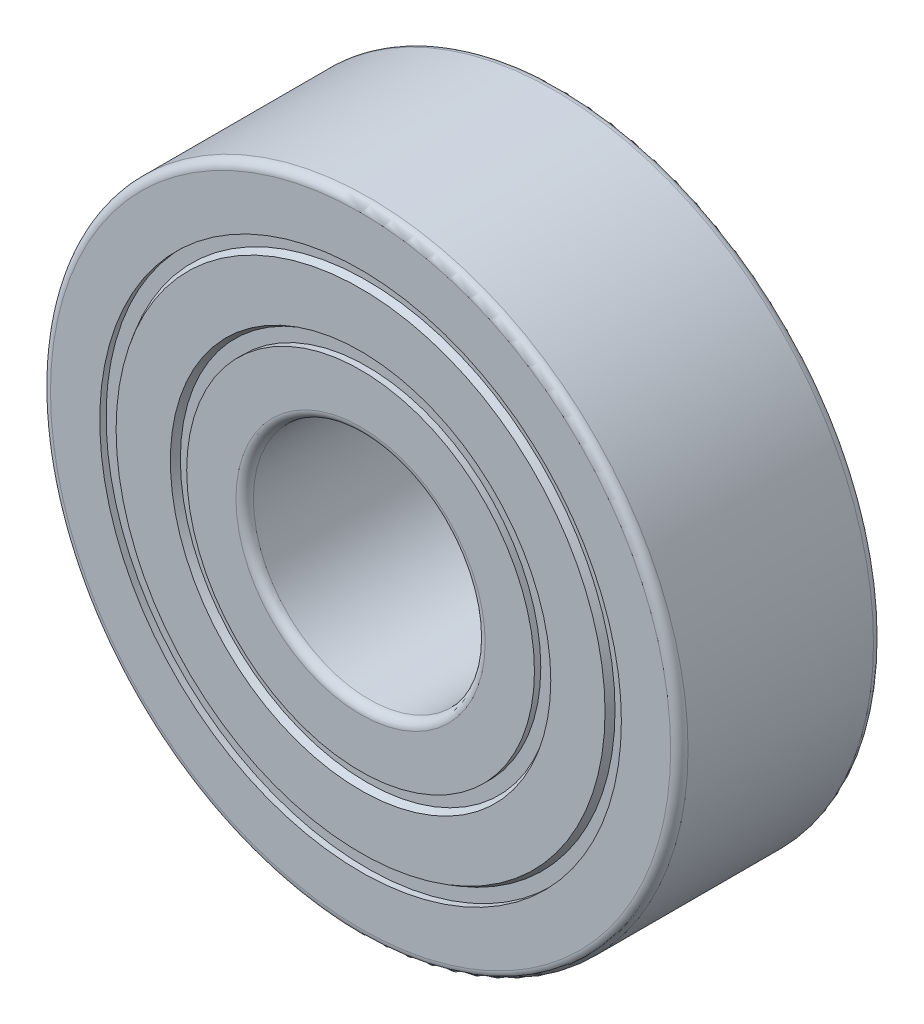
ISO-10303-21;
HEADER;
FILE_DESCRIPTION(('STEP AP214'),'2;1');
FILE_NAME('part.step','',(''),(''),'','','');
FILE_SCHEMA(('AUTOMOTIVE_DESIGN { 1 0 10303 214 1 1 1 1 }'));
ENDSEC;
DATA;
#1=APPLICATION_CONTEXT('core data for automotive mechanical design processes');
#2=APPLICATION_PROTOCOL_DEFINITION('international standard','automotive_design',2000,#1);
#3=PRODUCT_CONTEXT('',#1,'mechanical');
#4=PRODUCT('Part','Part','',(#3));
#5=PRODUCT_RELATED_PRODUCT_CATEGORY('part','',(#4));
#6=PRODUCT_DEFINITION_FORMATION('','',#4);
#7=PRODUCT_DEFINITION_CONTEXT('part definition',#1,'design');
#8=PRODUCT_DEFINITION('design','',#6,#7);
#9=PRODUCT_DEFINITION_SHAPE('','',#8);
#10=(LENGTH_UNIT() NAMED_UNIT(*) SI_UNIT(.MILLI.,.METRE.));
#11=(NAMED_UNIT(*) PLANE_ANGLE_UNIT() SI_UNIT($,.RADIAN.));
#12=(NAMED_UNIT(*) SI_UNIT($,.STERADIAN.) SOLID_ANGLE_UNIT());
#13=UNCERTAINTY_MEASURE_WITH_UNIT(LENGTH_MEASURE(1.E-05),#10,'distance_accuracy_value','');
#14=(GEOMETRIC_REPRESENTATION_CONTEXT(3) GLOBAL_UNCERTAINTY_ASSIGNED_CONTEXT((#13)) GLOBAL_UNIT_ASSIGNED_CONTEXT((#10,
#11,#12)) REPRESENTATION_CONTEXT('',''));
#15=CARTESIAN_POINT('',(0.,0.,0.));
#16=DIRECTION('',(0.,0.,1.));
#17=DIRECTION('',(1.,0.,0.));
#18=AXIS2_PLACEMENT_3D('',#15,#16,#17);
#19=CARTESIAN_POINT('',(-9.,0.,7.));
#20=DIRECTION('',(0.,0.,-1.));
#21=DIRECTION('',(-1.,0.,0.));
#22=AXIS2_PLACEMENT_3D('',#19,#20,#21);
#23=PLANE('',#22);
#24=CARTESIAN_POINT('',(0.,0.,7.));
#25=DIRECTION('',(0.,0.,1.));
#26=DIRECTION('',(1.,0.,0.));
#27=AXIS2_PLACEMENT_3D('',#24,#25,#26);
#28=CIRCLE('',#27,9.);
#29=CARTESIAN_POINT('',(9.,0.,7.));
#30=VERTEX_POINT('',#29);
#31=EDGE_CURVE('E10',#30,#30,#28,.T.);
#32=ORIENTED_EDGE('',*,*,#31,.F.);
#33=EDGE_LOOP('',(#32));
#34=FACE_BOUND('',#33,.T.);
#35=CARTESIAN_POINT('',(0.,0.,7.));
#36=DIRECTION('',(0.,0.,1.));
#37=DIRECTION('',(1.,0.,0.));
#38=AXIS2_PLACEMENT_3D('',#35,#36,#37);
#39=CIRCLE('',#38,10.7);
#40=CARTESIAN_POINT('',(10.7,0.,7.));
#41=VERTEX_POINT('',#40);
#42=EDGE_CURVE('E108',#41,#41,#39,.T.);
#43=ORIENTED_EDGE('',*,*,#42,.T.);
#44=EDGE_LOOP('',(#43));
#45=FACE_BOUND('',#44,.T.);
#46=ADVANCED_FACE('F31',(#34,#45),#23,.F.);
#47=CARTESIAN_POINT('',(0.,0.,19.));
#48=DIRECTION('',(0.,0.,1.));
#49=DIRECTION('',(1.,0.,0.));
#50=AXIS2_PLACEMENT_3D('',#47,#48,#49);
#51=CYLINDRICAL_SURFACE('',#50,9.);
#52=CARTESIAN_POINT('',(0.,0.,6.78125));
#53=DIRECTION('',(0.,0.,1.));
#54=DIRECTION('',(1.,0.,0.));
#55=AXIS2_PLACEMENT_3D('',#52,#53,#54);
#56=CIRCLE('',#55,9.);
#57=CARTESIAN_POINT('',(9.,0.,6.78125));
#58=VERTEX_POINT('',#57);
#59=EDGE_CURVE('E38',#58,#58,#56,.T.);
#60=ORIENTED_EDGE('',*,*,#59,.F.);
#61=EDGE_LOOP('',(#60));
#62=FACE_BOUND('',#61,.T.);
#63=ORIENTED_EDGE('',*,*,#31,.T.);
#64=EDGE_LOOP('',(#63));
#65=FACE_BOUND('',#64,.T.);
#66=ADVANCED_FACE('F241',(#62,#65),#51,.F.);
#67=CARTESIAN_POINT('',(-9.,0.,6.78125));
#68=DIRECTION('',(0.,0.,-1.));
#69=DIRECTION('',(-1.,0.,0.));
#70=AXIS2_PLACEMENT_3D('',#67,#68,#69);
#71=PLANE('',#70);
#72=CARTESIAN_POINT('',(0.,0.,6.78125));
#73=DIRECTION('',(0.,0.,1.));
#74=DIRECTION('',(1.,0.,0.));
#75=AXIS2_PLACEMENT_3D('',#72,#73,#74);
#76=CIRCLE('',#75,8.5625);
#77=CARTESIAN_POINT('',(8.5625,0.,6.78125));
#78=VERTEX_POINT('',#77);
#79=EDGE_CURVE('E42',#78,#78,#76,.T.);
#80=ORIENTED_EDGE('',*,*,#79,.F.);
#81=EDGE_LOOP('',(#80));
#82=FACE_BOUND('',#81,.T.);
#83=ORIENTED_EDGE('',*,*,#59,.T.);
#84=EDGE_LOOP('',(#83));
#85=FACE_BOUND('',#84,.T.);
#86=ADVANCED_FACE('F236',(#82,#85),#71,.F.);
#87=CARTESIAN_POINT('',(0.,0.,6.78125));
#88=DIRECTION('',(0.,0.,-1.));
#89=DIRECTION('',(-1.,0.,0.));
#90=AXIS2_PLACEMENT_3D('',#87,#88,#89);
#91=CONICAL_SURFACE('',#90,8.5625,0.523598775598308);
#92=CARTESIAN_POINT('',(0.,0.,7.));
#93=DIRECTION('',(0.,0.,1.));
#94=DIRECTION('',(1.,0.,0.));
#95=AXIS2_PLACEMENT_3D('',#92,#93,#94);
#96=CIRCLE('',#95,8.43620462861477);
#97=CARTESIAN_POINT('',(8.43620462861477,0.,7.));
#98=VERTEX_POINT('',#97);
#99=EDGE_CURVE('E46',#98,#98,#96,.T.);
#100=ORIENTED_EDGE('',*,*,#99,.F.);
#101=EDGE_LOOP('',(#100));
#102=FACE_BOUND('',#101,.T.);
#103=ORIENTED_EDGE('',*,*,#79,.T.);
#104=EDGE_LOOP('',(#103));
#105=FACE_BOUND('',#104,.T.);
#106=ADVANCED_FACE('F230',(#102,#105),#91,.T.);
#107=CARTESIAN_POINT('',(-8.43620462861477,0.,7.));
#108=DIRECTION('',(0.,0.,-1.));
#109=DIRECTION('',(-1.,0.,0.));
#110=AXIS2_PLACEMENT_3D('',#107,#108,#109);
#111=PLANE('',#110);
#112=CARTESIAN_POINT('',(0.,0.,7.));
#113=DIRECTION('',(0.,0.,1.));
#114=DIRECTION('',(1.,0.,0.));
#115=AXIS2_PLACEMENT_3D('',#112,#113,#114);
#116=CIRCLE('',#115,6.56379537138523);
#117=CARTESIAN_POINT('',(6.56379537138523,0.,7.));
#118=VERTEX_POINT('',#117);
#119=EDGE_CURVE('E51',#118,#118,#116,.T.);
#120=ORIENTED_EDGE('',*,*,#119,.F.);
#121=EDGE_LOOP('',(#120));
#122=FACE_BOUND('',#121,.T.);
#123=ORIENTED_EDGE('',*,*,#99,.T.);
#124=EDGE_LOOP('',(#123));
#125=FACE_BOUND('',#124,.T.);
#126=ADVANCED_FACE('F224',(#122,#125),#111,.F.);
#127=CARTESIAN_POINT('',(0.,0.,7.));
#128=DIRECTION('',(0.,0.,1.));
#129=DIRECTION('',(1.,0.,0.));
#130=AXIS2_PLACEMENT_3D('',#127,#128,#129);
#131=CONICAL_SURFACE('',#130,6.56379537138523,0.523598775598303);
#132=CARTESIAN_POINT('',(0.,0.,6.78125));
#133=DIRECTION('',(0.,0.,1.));
#134=DIRECTION('',(1.,0.,0.));
#135=AXIS2_PLACEMENT_3D('',#132,#133,#134);
#136=CIRCLE('',#135,6.4375);
#137=CARTESIAN_POINT('',(6.4375,0.,6.78125));
#138=VERTEX_POINT('',#137);
#139=EDGE_CURVE('E54',#138,#138,#136,.T.);
#140=ORIENTED_EDGE('',*,*,#139,.F.);
#141=EDGE_LOOP('',(#140));
#142=FACE_BOUND('',#141,.T.);
#143=ORIENTED_EDGE('',*,*,#119,.T.);
#144=EDGE_LOOP('',(#143));
#145=FACE_BOUND('',#144,.T.);
#146=ADVANCED_FACE('F218',(#142,#145),#131,.F.);
#147=CARTESIAN_POINT('',(-6.,0.,6.78125));
#148=DIRECTION('',(0.,0.,-1.));
#149=DIRECTION('',(-1.,0.,0.));
#150=AXIS2_PLACEMENT_3D('',#147,#148,#149);
#151=PLANE('',#150);
#152=CARTESIAN_POINT('',(0.,0.,6.78125));
#153=DIRECTION('',(0.,0.,1.));
#154=DIRECTION('',(1.,0.,0.));
#155=AXIS2_PLACEMENT_3D('',#152,#153,#154);
#156=CIRCLE('',#155,6.);
#157=CARTESIAN_POINT('',(6.,0.,6.78125));
#158=VERTEX_POINT('',#157);
#159=EDGE_CURVE('E57',#158,#158,#156,.T.);
#160=ORIENTED_EDGE('',*,*,#159,.F.);
#161=EDGE_LOOP('',(#160));
#162=FACE_BOUND('',#161,.T.);
#163=ORIENTED_EDGE('',*,*,#139,.T.);
#164=EDGE_LOOP('',(#163));
#165=FACE_BOUND('',#164,.T.);
#166=ADVANCED_FACE('F212',(#162,#165),#151,.F.);
#167=CARTESIAN_POINT('',(0.,0.,19.));
#168=DIRECTION('',(0.,0.,1.));
#169=DIRECTION('',(1.,0.,0.));
#170=AXIS2_PLACEMENT_3D('',#167,#168,#169);
#171=CYLINDRICAL_SURFACE('',#170,6.);
#172=CARTESIAN_POINT('',(0.,0.,7.));
#173=DIRECTION('',(0.,0.,1.));
#174=DIRECTION('',(1.,0.,0.));
#175=AXIS2_PLACEMENT_3D('',#172,#173,#174);
#176=CIRCLE('',#175,6.);
#177=CARTESIAN_POINT('',(6.,0.,7.));
#178=VERTEX_POINT('',#177);
#179=EDGE_CURVE('E60',#178,#178,#176,.T.);
#180=ORIENTED_EDGE('',*,*,#179,.F.);
#181=EDGE_LOOP('',(#180));
#182=FACE_BOUND('',#181,.T.);
#183=ORIENTED_EDGE('',*,*,#159,.T.);
#184=EDGE_LOOP('',(#183));
#185=FACE_BOUND('',#184,.T.);
#186=ADVANCED_FACE('F206',(#182,#185),#171,.T.);
#187=CARTESIAN_POINT('',(-4.3,0.,7.));
#188=DIRECTION('',(0.,0.,-1.));
#189=DIRECTION('',(-1.,0.,0.));
#190=AXIS2_PLACEMENT_3D('',#187,#188,#189);
#191=PLANE('',#190);
#192=CARTESIAN_POINT('',(0.,0.,7.));
#193=DIRECTION('',(0.,0.,1.));
#194=DIRECTION('',(1.,0.,0.));
#195=AXIS2_PLACEMENT_3D('',#192,#193,#194);
#196=CIRCLE('',#195,4.3);
#197=CARTESIAN_POINT('',(4.3,0.,7.));
#198=VERTEX_POINT('',#197);
#199=EDGE_CURVE('E63',#198,#198,#196,.T.);
#200=ORIENTED_EDGE('',*,*,#199,.F.);
#201=EDGE_LOOP('',(#200));
#202=FACE_BOUND('',#201,.T.);
#203=ORIENTED_EDGE('',*,*,#179,.T.);
#204=EDGE_LOOP('',(#203));
#205=FACE_BOUND('',#204,.T.);
#206=ADVANCED_FACE('F200',(#202,#205),#191,.F.);
#207=CARTESIAN_POINT('',(0.,0.,6.7));
#208=DIRECTION('',(0.,0.,1.));
#209=DIRECTION('',(1.,0.,0.));
#210=AXIS2_PLACEMENT_3D('',#207,#208,#209);
#211=TOROIDAL_SURFACE('',#210,4.3,0.3);
#212=CARTESIAN_POINT('',(0.,0.,6.7));
#213=DIRECTION('',(0.,0.,1.));
#214=DIRECTION('',(1.,0.,0.));
#215=AXIS2_PLACEMENT_3D('',#212,#213,#214);
#216=CIRCLE('',#215,4.);
#217=CARTESIAN_POINT('',(4.,0.,6.7));
#218=VERTEX_POINT('',#217);
#219=EDGE_CURVE('E66',#218,#218,#216,.T.);
#220=ORIENTED_EDGE('',*,*,#219,.F.);
#221=EDGE_LOOP('',(#220));
#222=FACE_BOUND('',#221,.T.);
#223=ORIENTED_EDGE('',*,*,#199,.T.);
#224=EDGE_LOOP('',(#223));
#225=FACE_BOUND('',#224,.T.);
#226=ADVANCED_FACE('F194',(#222,#225),#211,.T.);
#227=CARTESIAN_POINT('',(0.,0.,19.));
#228=DIRECTION('',(0.,0.,1.));
#229=DIRECTION('',(1.,0.,0.));
#230=AXIS2_PLACEMENT_3D('',#227,#228,#229);
#231=CYLINDRICAL_SURFACE('',#230,4.);
#232=CARTESIAN_POINT('',(0.,0.,0.300000000000002));
#233=DIRECTION('',(0.,0.,1.));
#234=DIRECTION('',(1.,0.,0.));
#235=AXIS2_PLACEMENT_3D('',#232,#233,#234);
#236=CIRCLE('',#235,4.);
#237=CARTESIAN_POINT('',(4.,0.,0.300000000000002));
#238=VERTEX_POINT('',#237);
#239=EDGE_CURVE('E69',#238,#238,#236,.T.);
#240=ORIENTED_EDGE('',*,*,#239,.F.);
#241=EDGE_LOOP('',(#240));
#242=FACE_BOUND('',#241,.T.);
#243=ORIENTED_EDGE('',*,*,#219,.T.);
#244=EDGE_LOOP('',(#243));
#245=FACE_BOUND('',#244,.T.);
#246=ADVANCED_FACE('F188',(#242,#245),#231,.F.);
#247=CARTESIAN_POINT('',(0.,0.,0.300000000000001));
#248=DIRECTION('',(0.,0.,1.));
#249=DIRECTION('',(1.,0.,0.));
#250=AXIS2_PLACEMENT_3D('',#247,#248,#249);
#251=TOROIDAL_SURFACE('',#250,4.3,0.3);
#252=CARTESIAN_POINT('',(0.,0.,0.));
#253=DIRECTION('',(0.,0.,1.));
#254=DIRECTION('',(1.,0.,0.));
#255=AXIS2_PLACEMENT_3D('',#252,#253,#254);
#256=CIRCLE('',#255,4.3);
#257=CARTESIAN_POINT('',(4.3,0.,0.));
#258=VERTEX_POINT('',#257);
#259=EDGE_CURVE('E72',#258,#258,#256,.T.);
#260=ORIENTED_EDGE('',*,*,#259,.F.);
#261=EDGE_LOOP('',(#260));
#262=FACE_BOUND('',#261,.T.);
#263=ORIENTED_EDGE('',*,*,#239,.T.);
#264=EDGE_LOOP('',(#263));
#265=FACE_BOUND('',#264,.T.);
#266=ADVANCED_FACE('F182',(#262,#265),#251,.T.);
#267=CARTESIAN_POINT('',(-4.3,0.,0.));
#268=DIRECTION('',(0.,0.,1.));
#269=DIRECTION('',(1.,0.,0.));
#270=AXIS2_PLACEMENT_3D('',#267,#268,#269);
#271=PLANE('',#270);
#272=CARTESIAN_POINT('',(0.,0.,0.));
#273=DIRECTION('',(0.,0.,1.));
#274=DIRECTION('',(1.,0.,0.));
#275=AXIS2_PLACEMENT_3D('',#272,#273,#274);
#276=CIRCLE('',#275,6.);
#277=CARTESIAN_POINT('',(6.,0.,0.));
#278=VERTEX_POINT('',#277);
#279=EDGE_CURVE('E75',#278,#278,#276,.T.);
#280=ORIENTED_EDGE('',*,*,#279,.F.);
#281=EDGE_LOOP('',(#280));
#282=FACE_BOUND('',#281,.T.);
#283=ORIENTED_EDGE('',*,*,#259,.T.);
#284=EDGE_LOOP('',(#283));
#285=FACE_BOUND('',#284,.T.);
#286=ADVANCED_FACE('F176',(#282,#285),#271,.F.);
#287=CARTESIAN_POINT('',(0.,0.,19.));
#288=DIRECTION('',(0.,0.,1.));
#289=DIRECTION('',(1.,0.,0.));
#290=AXIS2_PLACEMENT_3D('',#287,#288,#289);
#291=CYLINDRICAL_SURFACE('',#290,6.);
#292=CARTESIAN_POINT('',(0.,0.,0.21875));
#293=DIRECTION('',(0.,0.,1.));
#294=DIRECTION('',(1.,0.,0.));
#295=AXIS2_PLACEMENT_3D('',#292,#293,#294);
#296=CIRCLE('',#295,6.);
#297=CARTESIAN_POINT('',(6.,0.,0.21875));
#298=VERTEX_POINT('',#297);
#299=EDGE_CURVE('E78',#298,#298,#296,.T.);
#300=ORIENTED_EDGE('',*,*,#299,.F.);
#301=EDGE_LOOP('',(#300));
#302=FACE_BOUND('',#301,.T.);
#303=ORIENTED_EDGE('',*,*,#279,.T.);
#304=EDGE_LOOP('',(#303));
#305=FACE_BOUND('',#304,.T.);
#306=ADVANCED_FACE('F170',(#302,#305),#291,.T.);
#307=CARTESIAN_POINT('',(-6.,0.,0.21875));
#308=DIRECTION('',(0.,0.,1.));
#309=DIRECTION('',(1.,0.,0.));
#310=AXIS2_PLACEMENT_3D('',#307,#308,#309);
#311=PLANE('',#310);
#312=CARTESIAN_POINT('',(0.,0.,0.21875));
#313=DIRECTION('',(0.,0.,1.));
#314=DIRECTION('',(1.,0.,0.));
#315=AXIS2_PLACEMENT_3D('',#312,#313,#314);
#316=CIRCLE('',#315,6.4375);
#317=CARTESIAN_POINT('',(6.4375,0.,0.21875));
#318=VERTEX_POINT('',#317);
#319=EDGE_CURVE('E81',#318,#318,#316,.T.);
#320=ORIENTED_EDGE('',*,*,#319,.F.);
#321=EDGE_LOOP('',(#320));
#322=FACE_BOUND('',#321,.T.);
#323=ORIENTED_EDGE('',*,*,#299,.T.);
#324=EDGE_LOOP('',(#323));
#325=FACE_BOUND('',#324,.T.);
#326=ADVANCED_FACE('F164',(#322,#325),#311,.F.);
#327=CARTESIAN_POINT('',(0.,0.,0.21875));
#328=DIRECTION('',(0.,0.,-1.));
#329=DIRECTION('',(-1.,0.,0.));
#330=AXIS2_PLACEMENT_3D('',#327,#328,#329);
#331=CONICAL_SURFACE('',#330,6.4375,0.523598775598303);
#332=CARTESIAN_POINT('',(0.,0.,0.));
#333=DIRECTION('',(0.,0.,1.));
#334=DIRECTION('',(1.,0.,0.));
#335=AXIS2_PLACEMENT_3D('',#332,#333,#334);
#336=CIRCLE('',#335,6.56379537138523);
#337=CARTESIAN_POINT('',(6.56379537138523,0.,0.));
#338=VERTEX_POINT('',#337);
#339=EDGE_CURVE('E84',#338,#338,#336,.T.);
#340=ORIENTED_EDGE('',*,*,#339,.F.);
#341=EDGE_LOOP('',(#340));
#342=FACE_BOUND('',#341,.T.);
#343=ORIENTED_EDGE('',*,*,#319,.T.);
#344=EDGE_LOOP('',(#343));
#345=FACE_BOUND('',#344,.T.);
#346=ADVANCED_FACE('F158',(#342,#345),#331,.F.);
#347=CARTESIAN_POINT('',(-8.43620462861477,0.,0.));
#348=DIRECTION('',(0.,0.,1.));
#349=DIRECTION('',(1.,0.,0.));
#350=AXIS2_PLACEMENT_3D('',#347,#348,#349);
#351=PLANE('',#350);
#352=CARTESIAN_POINT('',(0.,0.,0.));
#353=DIRECTION('',(0.,0.,1.));
#354=DIRECTION('',(1.,0.,0.));
#355=AXIS2_PLACEMENT_3D('',#352,#353,#354);
#356=CIRCLE('',#355,8.43620462861477);
#357=CARTESIAN_POINT('',(8.43620462861477,0.,0.));
#358=VERTEX_POINT('',#357);
#359=EDGE_CURVE('E87',#358,#358,#356,.T.);
#360=ORIENTED_EDGE('',*,*,#359,.F.);
#361=EDGE_LOOP('',(#360));
#362=FACE_BOUND('',#361,.T.);
#363=ORIENTED_EDGE('',*,*,#339,.T.);
#364=EDGE_LOOP('',(#363));
#365=FACE_BOUND('',#364,.T.);
#366=ADVANCED_FACE('F152',(#362,#365),#351,.F.);
#367=CARTESIAN_POINT('',(0.,0.,0.));
#368=DIRECTION('',(0.,0.,1.));
#369=DIRECTION('',(1.,0.,0.));
#370=AXIS2_PLACEMENT_3D('',#367,#368,#369);
#371=CONICAL_SURFACE('',#370,8.43620462861477,0.523598775598308);
#372=CARTESIAN_POINT('',(0.,0.,0.21875));
#373=DIRECTION('',(0.,0.,1.));
#374=DIRECTION('',(1.,0.,0.));
#375=AXIS2_PLACEMENT_3D('',#372,#373,#374);
#376=CIRCLE('',#375,8.5625);
#377=CARTESIAN_POINT('',(8.5625,0.,0.21875));
#378=VERTEX_POINT('',#377);
#379=EDGE_CURVE('E90',#378,#378,#376,.T.);
#380=ORIENTED_EDGE('',*,*,#379,.F.);
#381=EDGE_LOOP('',(#380));
#382=FACE_BOUND('',#381,.T.);
#383=ORIENTED_EDGE('',*,*,#359,.T.);
#384=EDGE_LOOP('',(#383));
#385=FACE_BOUND('',#384,.T.);
#386=ADVANCED_FACE('F146',(#382,#385),#371,.T.);
#387=CARTESIAN_POINT('',(-9.,0.,0.21875));
#388=DIRECTION('',(0.,0.,1.));
#389=DIRECTION('',(1.,0.,0.));
#390=AXIS2_PLACEMENT_3D('',#387,#388,#389);
#391=PLANE('',#390);
#392=CARTESIAN_POINT('',(0.,0.,0.21875));
#393=DIRECTION('',(0.,0.,1.));
#394=DIRECTION('',(1.,0.,0.));
#395=AXIS2_PLACEMENT_3D('',#392,#393,#394);
#396=CIRCLE('',#395,9.);
#397=CARTESIAN_POINT('',(9.,0.,0.21875));
#398=VERTEX_POINT('',#397);
#399=EDGE_CURVE('E93',#398,#398,#396,.T.);
#400=ORIENTED_EDGE('',*,*,#399,.F.);
#401=EDGE_LOOP('',(#400));
#402=FACE_BOUND('',#401,.T.);
#403=ORIENTED_EDGE('',*,*,#379,.T.);
#404=EDGE_LOOP('',(#403));
#405=FACE_BOUND('',#404,.T.);
#406=ADVANCED_FACE('F140',(#402,#405),#391,.F.);
#407=CARTESIAN_POINT('',(0.,0.,19.));
#408=DIRECTION('',(0.,0.,1.));
#409=DIRECTION('',(1.,0.,0.));
#410=AXIS2_PLACEMENT_3D('',#407,#408,#409);
#411=CYLINDRICAL_SURFACE('',#410,9.);
#412=CARTESIAN_POINT('',(0.,0.,0.));
#413=DIRECTION('',(0.,0.,1.));
#414=DIRECTION('',(1.,0.,0.));
#415=AXIS2_PLACEMENT_3D('',#412,#413,#414);
#416=CIRCLE('',#415,9.);
#417=CARTESIAN_POINT('',(9.,0.,0.));
#418=VERTEX_POINT('',#417);
#419=EDGE_CURVE('E96',#418,#418,#416,.T.);
#420=ORIENTED_EDGE('',*,*,#419,.F.);
#421=EDGE_LOOP('',(#420));
#422=FACE_BOUND('',#421,.T.);
#423=ORIENTED_EDGE('',*,*,#399,.T.);
#424=EDGE_LOOP('',(#423));
#425=FACE_BOUND('',#424,.T.);
#426=ADVANCED_FACE('F134',(#422,#425),#411,.F.);
#427=CARTESIAN_POINT('',(-9.,0.,0.));
#428=DIRECTION('',(0.,0.,1.));
#429=DIRECTION('',(1.,0.,0.));
#430=AXIS2_PLACEMENT_3D('',#427,#428,#429);
#431=PLANE('',#430);
#432=CARTESIAN_POINT('',(0.,0.,0.));
#433=DIRECTION('',(0.,0.,1.));
#434=DIRECTION('',(1.,0.,0.));
#435=AXIS2_PLACEMENT_3D('',#432,#433,#434);
#436=CIRCLE('',#435,10.7);
#437=CARTESIAN_POINT('',(10.7,0.,0.));
#438=VERTEX_POINT('',#437);
#439=EDGE_CURVE('E99',#438,#438,#436,.T.);
#440=ORIENTED_EDGE('',*,*,#439,.F.);
#441=EDGE_LOOP('',(#440));
#442=FACE_BOUND('',#441,.T.);
#443=ORIENTED_EDGE('',*,*,#419,.T.);
#444=EDGE_LOOP('',(#443));
#445=FACE_BOUND('',#444,.T.);
#446=ADVANCED_FACE('F128',(#442,#445),#431,.F.);
#447=CARTESIAN_POINT('',(0.,0.,0.299999999999999));
#448=DIRECTION('',(0.,0.,1.));
#449=DIRECTION('',(1.,0.,0.));
#450=AXIS2_PLACEMENT_3D('',#447,#448,#449);
#451=TOROIDAL_SURFACE('',#450,10.7,0.3);
#452=CARTESIAN_POINT('',(0.,0.,0.299999999999998));
#453=DIRECTION('',(0.,0.,1.));
#454=DIRECTION('',(1.,0.,0.));
#455=AXIS2_PLACEMENT_3D('',#452,#453,#454);
#456=CIRCLE('',#455,11.);
#457=CARTESIAN_POINT('',(11.,0.,0.299999999999998));
#458=VERTEX_POINT('',#457);
#459=EDGE_CURVE('E102',#458,#458,#456,.T.);
#460=ORIENTED_EDGE('',*,*,#459,.F.);
#461=EDGE_LOOP('',(#460));
#462=FACE_BOUND('',#461,.T.);
#463=ORIENTED_EDGE('',*,*,#439,.T.);
#464=EDGE_LOOP('',(#463));
#465=FACE_BOUND('',#464,.T.);
#466=ADVANCED_FACE('F122',(#462,#465),#451,.T.);
#467=CARTESIAN_POINT('',(0.,0.,19.));
#468=DIRECTION('',(0.,0.,1.));
#469=DIRECTION('',(1.,0.,0.));
#470=AXIS2_PLACEMENT_3D('',#467,#468,#469);
#471=CYLINDRICAL_SURFACE('',#470,11.);
#472=CARTESIAN_POINT('',(0.,0.,6.7));
#473=DIRECTION('',(0.,0.,1.));
#474=DIRECTION('',(1.,0.,0.));
#475=AXIS2_PLACEMENT_3D('',#472,#473,#474);
#476=CIRCLE('',#475,11.);
#477=CARTESIAN_POINT('',(11.,0.,6.7));
#478=VERTEX_POINT('',#477);
#479=EDGE_CURVE('E105',#478,#478,#476,.T.);
#480=ORIENTED_EDGE('',*,*,#479,.F.);
#481=EDGE_LOOP('',(#480));
#482=FACE_BOUND('',#481,.T.);
#483=ORIENTED_EDGE('',*,*,#459,.T.);
#484=EDGE_LOOP('',(#483));
#485=FACE_BOUND('',#484,.T.);
#486=ADVANCED_FACE('F116',(#482,#485),#471,.T.);
#487=CARTESIAN_POINT('',(0.,0.,6.7));
#488=DIRECTION('',(0.,0.,1.));
#489=DIRECTION('',(1.,0.,0.));
#490=AXIS2_PLACEMENT_3D('',#487,#488,#489);
#491=TOROIDAL_SURFACE('',#490,10.7,0.3);
#492=ORIENTED_EDGE('',*,*,#42,.F.);
#493=EDGE_LOOP('',(#492));
#494=FACE_BOUND('',#493,.T.);
#495=ORIENTED_EDGE('',*,*,#479,.T.);
#496=EDGE_LOOP('',(#495));
#497=FACE_BOUND('',#496,.T.);
#498=ADVANCED_FACE('F113',(#494,#497),#491,.T.);
#499=CLOSED_SHELL('',(#46,#66,#86,#106,#126,#146,#166,#186,#206,#226,#246,#266,#286,#306,#326,
#346,#366,#386,#406,#426,#446,#466,#486,#498));
#500=CARTESIAN_POINT('',(0.,0.,3.5));
#501=DIRECTION('',(0.,0.,1.));
#502=DIRECTION('',(1.,0.,0.));
#503=AXIS2_PLACEMENT_3D('',#500,#501,#502);
#504=TOROIDAL_SURFACE('',#503,7.5,2.1875);
#505=CARTESIAN_POINT('',(9.6875,0.,3.5));
#506=VERTEX_POINT('',#505);
#507=VERTEX_LOOP('',#506);
#508=FACE_BOUND('',#507,.T.);
#509=ADVANCED_FACE('F403',(#508),#504,.F.);
#510=CLOSED_SHELL('',(#509));
#511=ORIENTED_CLOSED_SHELL('',*,#510,.T.);
#512=BREP_WITH_VOIDS('B2',#499,(#511));
#513=ADVANCED_BREP_SHAPE_REPRESENTATION('',(#18,#512),#14);
#514=SHAPE_DEFINITION_REPRESENTATION(#9,#513);
ENDSEC;
END-ISO-10303-21;
